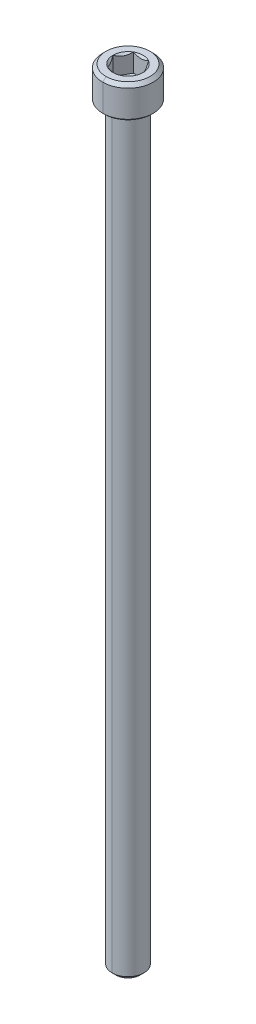
ISO-10303-21;
HEADER;
FILE_DESCRIPTION(('STEP AP214'),'2;1');
FILE_NAME('part.step','',(''),(''),'','','');
FILE_SCHEMA(('AUTOMOTIVE_DESIGN { 1 0 10303 214 1 1 1 1 }'));
ENDSEC;
DATA;
#1=APPLICATION_CONTEXT('core data for automotive mechanical design processes');
#2=APPLICATION_PROTOCOL_DEFINITION('international standard','automotive_design',2000,#1);
#3=PRODUCT_CONTEXT('',#1,'mechanical');
#4=PRODUCT('Part','Part','',(#3));
#5=PRODUCT_RELATED_PRODUCT_CATEGORY('part','',(#4));
#6=PRODUCT_DEFINITION_FORMATION('','',#4);
#7=PRODUCT_DEFINITION_CONTEXT('part definition',#1,'design');
#8=PRODUCT_DEFINITION('design','',#6,#7);
#9=PRODUCT_DEFINITION_SHAPE('','',#8);
#10=(LENGTH_UNIT() NAMED_UNIT(*) SI_UNIT(.MILLI.,.METRE.));
#11=(NAMED_UNIT(*) PLANE_ANGLE_UNIT() SI_UNIT($,.RADIAN.));
#12=(NAMED_UNIT(*) SI_UNIT($,.STERADIAN.) SOLID_ANGLE_UNIT());
#13=UNCERTAINTY_MEASURE_WITH_UNIT(LENGTH_MEASURE(1.E-05),#10,'distance_accuracy_value','');
#14=(GEOMETRIC_REPRESENTATION_CONTEXT(3) GLOBAL_UNCERTAINTY_ASSIGNED_CONTEXT((#13)) GLOBAL_UNIT_ASSIGNED_CONTEXT((#10,
#11,#12)) REPRESENTATION_CONTEXT('',''));
#15=CARTESIAN_POINT('',(0.,0.,0.));
#16=DIRECTION('',(0.,0.,1.));
#17=DIRECTION('',(1.,0.,0.));
#18=AXIS2_PLACEMENT_3D('',#15,#16,#17);
#19=CARTESIAN_POINT('',(0.,-0.152399999999997,0.));
#20=DIRECTION('',(0.,1.,0.));
#21=DIRECTION('',(0.,0.,1.));
#22=AXIS2_PLACEMENT_3D('',#19,#20,#21);
#23=TOROIDAL_SURFACE('',#22,2.5654,0.1524);
#24=CARTESIAN_POINT('',(0.,-0.152399999999997,-2.5654));
#25=DIRECTION('',(1.,0.,0.));
#26=DIRECTION('',(0.,0.,-1.));
#27=AXIS2_PLACEMENT_3D('',#24,#25,#26);
#28=CIRCLE('',#27,0.1524);
#29=CARTESIAN_POINT('',(0.,0.,-2.5654));
#30=VERTEX_POINT('',#29);
#31=CARTESIAN_POINT('',(0.,-0.152399999999997,-2.413));
#32=VERTEX_POINT('',#31);
#33=EDGE_CURVE('E203',#30,#32,#28,.T.);
#34=ORIENTED_EDGE('',*,*,#33,.F.);
#35=CARTESIAN_POINT('',(0.,0.,0.));
#36=DIRECTION('',(0.,1.,0.));
#37=DIRECTION('',(0.,0.,1.));
#38=AXIS2_PLACEMENT_3D('',#35,#36,#37);
#39=CIRCLE('',#38,2.5654);
#40=CARTESIAN_POINT('',(0.,0.,2.5654));
#41=VERTEX_POINT('',#40);
#42=EDGE_CURVE('E225',#41,#30,#39,.T.);
#43=ORIENTED_EDGE('',*,*,#42,.F.);
#44=CARTESIAN_POINT('',(0.,-0.152399999999997,2.5654));
#45=DIRECTION('',(-1.,0.,0.));
#46=DIRECTION('',(0.,0.,1.));
#47=AXIS2_PLACEMENT_3D('',#44,#45,#46);
#48=CIRCLE('',#47,0.1524);
#49=CARTESIAN_POINT('',(0.,-0.152399999999997,2.413));
#50=VERTEX_POINT('',#49);
#51=EDGE_CURVE('E250',#41,#50,#48,.T.);
#52=ORIENTED_EDGE('',*,*,#51,.T.);
#53=CARTESIAN_POINT('',(0.,-0.152399999999997,0.));
#54=DIRECTION('',(0.,-1.,0.));
#55=DIRECTION('',(0.,0.,1.));
#56=AXIS2_PLACEMENT_3D('',#53,#54,#55);
#57=CIRCLE('',#56,2.413);
#58=EDGE_CURVE('E235',#32,#50,#57,.T.);
#59=ORIENTED_EDGE('',*,*,#58,.F.);
#60=EDGE_LOOP('',(#34,#43,#52,#59));
#61=FACE_BOUND('',#60,.T.);
#62=ADVANCED_FACE('F16',(#61),#23,.F.);
#63=CARTESIAN_POINT('',(2.28769270663697,2.032,0.));
#64=DIRECTION('',(0.866025403784439,0.,-0.5));
#65=DIRECTION('',(0.,-1.,0.));
#66=AXIS2_PLACEMENT_3D('',#63,#64,#65);
#67=PLANE('',#66);
#68=DIRECTION('',(0.,1.,0.));
#69=VECTOR('',#68,1.);
#70=CARTESIAN_POINT('',(2.28769270663697,2.032,0.));
#71=LINE('',#70,#69);
#72=CARTESIAN_POINT('',(2.28769270663697,2.032,0.));
#73=VERTEX_POINT('',#72);
#74=CARTESIAN_POINT('',(2.28769270663697,4.826,0.));
#75=VERTEX_POINT('',#74);
#76=EDGE_CURVE('E11',#73,#75,#71,.T.);
#77=ORIENTED_EDGE('',*,*,#76,.T.);
#78=CARTESIAN_POINT('',(2.28769270663697,4.826,0.));
#79=CARTESIAN_POINT('',(2.14317957440595,4.68148686776898,-0.250304087385059));
#80=CARTESIAN_POINT('',(2.01227876614631,4.6063557329633,-0.477030938042588));
#81=CARTESIAN_POINT('',(1.86218187125153,4.52020691391333,-0.737006386058674));
#82=CARTESIAN_POINT('',(1.71787595811445,4.51951177250135,-0.986951559444716));
#83=CARTESIAN_POINT('',(1.5738329827954,4.51881789769698,-1.23644131117069));
#84=CARTESIAN_POINT('',(1.42308868167617,4.6041731544126,-1.49753809966066));
#85=CARTESIAN_POINT('',(1.29072619033411,4.67912016298365,-1.7267966596815));
#86=CARTESIAN_POINT('',(1.14384635331849,4.826,-1.9812));
#87=B_SPLINE_CURVE_WITH_KNOTS('',2,(#78,#79,#80,#81,#82,#83,#84,#85,#86),.UNSPECIFIED.,.F.,.F.,
(3,2,2,2,3),(0.,0.25,0.5,0.75,1.),.UNSPECIFIED.);
#88=CARTESIAN_POINT('',(1.14384635331849,4.826,-1.9812));
#89=VERTEX_POINT('',#88);
#90=EDGE_CURVE('E276',#75,#89,#87,.T.);
#91=ORIENTED_EDGE('',*,*,#90,.T.);
#92=DIRECTION('',(0.,1.,0.));
#93=VECTOR('',#92,1.);
#94=CARTESIAN_POINT('',(1.14384635331849,2.032,-1.9812));
#95=LINE('',#94,#93);
#96=CARTESIAN_POINT('',(1.14384635331849,2.032,-1.9812));
#97=VERTEX_POINT('',#96);
#98=EDGE_CURVE('E409',#97,#89,#95,.T.);
#99=ORIENTED_EDGE('',*,*,#98,.F.);
#100=DIRECTION('',(-0.5,0.,-0.866025403784439));
#101=VECTOR('',#100,1.);
#102=CARTESIAN_POINT('',(2.28769270663697,2.032,0.));
#103=LINE('',#102,#101);
#104=EDGE_CURVE('E270',#73,#97,#103,.T.);
#105=ORIENTED_EDGE('',*,*,#104,.F.);
#106=EDGE_LOOP('',(#77,#91,#99,#105));
#107=FACE_BOUND('',#106,.T.);
#108=ADVANCED_FACE('F283',(#107),#67,.F.);
#109=CARTESIAN_POINT('',(1.14384635331849,2.032,1.9812));
#110=DIRECTION('',(0.866025403784439,0.,0.5));
#111=DIRECTION('',(0.,-1.,0.));
#112=AXIS2_PLACEMENT_3D('',#109,#110,#111);
#113=PLANE('',#112);
#114=DIRECTION('',(0.,1.,0.));
#115=VECTOR('',#114,1.);
#116=CARTESIAN_POINT('',(1.14384635331849,2.032,1.9812));
#117=LINE('',#116,#115);
#118=CARTESIAN_POINT('',(1.14384635331849,2.032,1.9812));
#119=VERTEX_POINT('',#118);
#120=CARTESIAN_POINT('',(1.14384635331849,4.826,1.9812));
#121=VERTEX_POINT('',#120);
#122=EDGE_CURVE('E29',#119,#121,#117,.T.);
#123=ORIENTED_EDGE('',*,*,#122,.T.);
#124=CARTESIAN_POINT('',(1.14384635331849,4.826,1.9812));
#125=CARTESIAN_POINT('',(1.28835948554838,4.6814868677701,1.7308959126169));
#126=CARTESIAN_POINT('',(1.41926029380915,4.60635573296329,1.50416906195741));
#127=CARTESIAN_POINT('',(1.56935718870215,4.5202069139138,1.24419361394442));
#128=CARTESIAN_POINT('',(1.71366310184101,4.51951177250135,0.994248440555283));
#129=CARTESIAN_POINT('',(1.85770607715928,4.51881789769651,0.744758688830662));
#130=CARTESIAN_POINT('',(2.00845037827929,4.6041731544126,0.48366190033934));
#131=CARTESIAN_POINT('',(2.14081286962138,4.67912016298368,0.254403340318435));
#132=CARTESIAN_POINT('',(2.28769270663697,4.826,0.));
#133=B_SPLINE_CURVE_WITH_KNOTS('',2,(#124,#125,#126,#127,#128,#129,#130,#131,#132),
.UNSPECIFIED.,.F.,.F.,(3,2,2,2,3),(0.,0.25,0.5,0.75,1.),.UNSPECIFIED.);
#134=EDGE_CURVE('E474',#121,#75,#133,.T.);
#135=ORIENTED_EDGE('',*,*,#134,.T.);
#136=ORIENTED_EDGE('',*,*,#76,.F.);
#137=DIRECTION('',(0.5,0.,-0.866025403784439));
#138=VECTOR('',#137,1.);
#139=CARTESIAN_POINT('',(1.14384635331849,2.032,1.9812));
#140=LINE('',#139,#138);
#141=EDGE_CURVE('E462',#119,#73,#140,.T.);
#142=ORIENTED_EDGE('',*,*,#141,.F.);
#143=EDGE_LOOP('',(#123,#135,#136,#142));
#144=FACE_BOUND('',#143,.T.);
#145=ADVANCED_FACE('F293',(#144),#113,.F.);
#146=CARTESIAN_POINT('',(-1.14384635331848,2.032,1.9812));
#147=DIRECTION('',(0.,0.,1.));
#148=DIRECTION('',(1.,0.,0.));
#149=AXIS2_PLACEMENT_3D('',#146,#147,#148);
#150=PLANE('',#149);
#151=DIRECTION('',(0.,1.,0.));
#152=VECTOR('',#151,1.);
#153=CARTESIAN_POINT('',(-1.14384635331848,2.032,1.9812));
#154=LINE('',#153,#152);
#155=CARTESIAN_POINT('',(-1.14384635331848,2.032,1.9812));
#156=VERTEX_POINT('',#155);
#157=CARTESIAN_POINT('',(-1.14384635331848,4.826,1.9812));
#158=VERTEX_POINT('',#157);
#159=EDGE_CURVE('E508',#156,#158,#154,.T.);
#160=ORIENTED_EDGE('',*,*,#159,.T.);
#161=CARTESIAN_POINT('',(-1.14384635331848,4.826,1.9812));
#162=CARTESIAN_POINT('',(-0.852604529161856,4.68037908792168,1.9812));
#163=CARTESIAN_POINT('',(-0.58892975472875,4.6051869937822,1.9812));
#164=CARTESIAN_POINT('',(-0.288478278545423,4.51950729336303,1.9812));
#165=CARTESIAN_POINT('',(0.,4.51950729336303,1.9812));
#166=B_SPLINE_CURVE_WITH_KNOTS('',2,(#161,#162,#163,#164,#165),.UNSPECIFIED.,.F.,.F.,(3,2,3),
(0.,0.5,1.),.UNSPECIFIED.);
#167=CARTESIAN_POINT('',(0.,4.51950729336303,1.9812));
#168=VERTEX_POINT('',#167);
#169=EDGE_CURVE('E513',#158,#168,#166,.T.);
#170=ORIENTED_EDGE('',*,*,#169,.T.);
#171=CARTESIAN_POINT('',(0.,4.51950729336303,1.9812));
#172=CARTESIAN_POINT('',(0.287946815411568,4.51950729336303,1.9812));
#173=CARTESIAN_POINT('',(0.588849780232636,4.60516420753973,1.9812));
#174=CARTESIAN_POINT('',(0.851987770474281,4.68007070857789,1.9812));
#175=CARTESIAN_POINT('',(1.14384635331849,4.826,1.9812));
#176=B_SPLINE_CURVE_WITH_KNOTS('',2,(#171,#172,#173,#174,#175),.UNSPECIFIED.,.F.,.F.,(3,2,3),
(0.,0.5,1.),.UNSPECIFIED.);
#177=EDGE_CURVE('E266',#168,#121,#176,.T.);
#178=ORIENTED_EDGE('',*,*,#177,.T.);
#179=ORIENTED_EDGE('',*,*,#122,.F.);
#180=DIRECTION('',(1.,0.,0.));
#181=VECTOR('',#180,1.);
#182=CARTESIAN_POINT('',(-1.14384635331848,2.032,1.9812));
#183=LINE('',#182,#181);
#184=EDGE_CURVE('E201',#156,#119,#183,.T.);
#185=ORIENTED_EDGE('',*,*,#184,.F.);
#186=EDGE_LOOP('',(#160,#170,#178,#179,#185));
#187=FACE_BOUND('',#186,.T.);
#188=ADVANCED_FACE('F296',(#187),#150,.F.);
#189=CARTESIAN_POINT('',(-2.28769270663697,2.032,0.));
#190=DIRECTION('',(-0.866025403784438,0.,0.5));
#191=DIRECTION('',(0.,1.,0.));
#192=AXIS2_PLACEMENT_3D('',#189,#190,#191);
#193=PLANE('',#192);
#194=DIRECTION('',(0.,1.,0.));
#195=VECTOR('',#194,1.);
#196=CARTESIAN_POINT('',(-2.28769270663697,2.032,0.));
#197=LINE('',#196,#195);
#198=CARTESIAN_POINT('',(-2.28769270663697,2.032,0.));
#199=VERTEX_POINT('',#198);
#200=CARTESIAN_POINT('',(-2.28769270663697,4.826,0.));
#201=VERTEX_POINT('',#200);
#202=EDGE_CURVE('E408',#199,#201,#197,.T.);
#203=ORIENTED_EDGE('',*,*,#202,.T.);
#204=CARTESIAN_POINT('',(-2.28769270663697,4.826,0.));
#205=CARTESIAN_POINT('',(-2.14317957440604,4.68148686776907,0.250304087384906));
#206=CARTESIAN_POINT('',(-2.01227876614631,4.6063557329633,0.477030938042588));
#207=CARTESIAN_POINT('',(-1.8621818712512,4.5202069139131,0.737006386059238));
#208=CARTESIAN_POINT('',(-1.71787595811445,4.51951177250135,0.986951559444715));
#209=CARTESIAN_POINT('',(-1.57383298279637,4.51881789769721,1.23644131116902));
#210=CARTESIAN_POINT('',(-1.42308868167617,4.6041731544126,1.49753809966066));
#211=CARTESIAN_POINT('',(-1.2907261903357,4.67912016298207,1.72679665967875));
#212=CARTESIAN_POINT('',(-1.14384635331849,4.826,1.9812));
#213=B_SPLINE_CURVE_WITH_KNOTS('',2,(#204,#205,#206,#207,#208,#209,#210,#211,#212),
.UNSPECIFIED.,.F.,.F.,(3,2,2,2,3),(0.,0.25,0.5,0.75,1.),.UNSPECIFIED.);
#214=EDGE_CURVE('E346',#201,#158,#213,.T.);
#215=ORIENTED_EDGE('',*,*,#214,.T.);
#216=ORIENTED_EDGE('',*,*,#159,.F.);
#217=DIRECTION('',(0.5,0.,0.866025403784439));
#218=VECTOR('',#217,1.);
#219=CARTESIAN_POINT('',(-2.28769270663697,2.032,0.));
#220=LINE('',#219,#218);
#221=EDGE_CURVE('E238',#199,#156,#220,.T.);
#222=ORIENTED_EDGE('',*,*,#221,.F.);
#223=EDGE_LOOP('',(#203,#215,#216,#222));
#224=FACE_BOUND('',#223,.T.);
#225=ADVANCED_FACE('F300',(#224),#193,.F.);
#226=CARTESIAN_POINT('',(-1.14384635331849,2.032,-1.9812));
#227=DIRECTION('',(-0.866025403784439,0.,-0.5));
#228=DIRECTION('',(-0.5,0.,0.866025403784439));
#229=AXIS2_PLACEMENT_3D('',#226,#227,#228);
#230=PLANE('',#229);
#231=DIRECTION('',(0.,1.,0.));
#232=VECTOR('',#231,1.);
#233=CARTESIAN_POINT('',(-1.14384635331849,2.032,-1.9812));
#234=LINE('',#233,#232);
#235=CARTESIAN_POINT('',(-1.14384635331849,2.032,-1.9812));
#236=VERTEX_POINT('',#235);
#237=CARTESIAN_POINT('',(-1.14384635331849,4.826,-1.9812));
#238=VERTEX_POINT('',#237);
#239=EDGE_CURVE('E400',#236,#238,#234,.T.);
#240=ORIENTED_EDGE('',*,*,#239,.T.);
#241=CARTESIAN_POINT('',(-1.14384635331849,4.826,-1.9812));
#242=CARTESIAN_POINT('',(-1.28835948554886,4.68148686776963,-1.73089591261607));
#243=CARTESIAN_POINT('',(-1.41926029380915,4.6063557329633,-1.50416906195741));
#244=CARTESIAN_POINT('',(-1.56935718870378,4.5202069139131,-1.24419361394159));
#245=CARTESIAN_POINT('',(-1.71366310184101,4.51951177250136,-0.994248440555283));
#246=CARTESIAN_POINT('',(-1.85770607715962,4.51881789769721,-0.744758688830066));
#247=CARTESIAN_POINT('',(-2.00845037827929,4.6041731544126,-0.48366190033934));
#248=CARTESIAN_POINT('',(-2.14081286962037,4.67912016298268,-0.254403340320189));
#249=CARTESIAN_POINT('',(-2.28769270663697,4.826,0.));
#250=B_SPLINE_CURVE_WITH_KNOTS('',2,(#241,#242,#243,#244,#245,#246,#247,#248,#249),
.UNSPECIFIED.,.F.,.F.,(3,2,2,2,3),(0.,0.25,0.5,0.75,1.),.UNSPECIFIED.);
#251=EDGE_CURVE('E395',#238,#201,#250,.T.);
#252=ORIENTED_EDGE('',*,*,#251,.T.);
#253=ORIENTED_EDGE('',*,*,#202,.F.);
#254=DIRECTION('',(-0.5,0.,0.866025403784439));
#255=VECTOR('',#254,1.);
#256=CARTESIAN_POINT('',(-1.14384635331849,2.032,-1.9812));
#257=LINE('',#256,#255);
#258=EDGE_CURVE('E242',#236,#199,#257,.T.);
#259=ORIENTED_EDGE('',*,*,#258,.F.);
#260=EDGE_LOOP('',(#240,#252,#253,#259));
#261=FACE_BOUND('',#260,.T.);
#262=ADVANCED_FACE('F362',(#261),#230,.F.);
#263=CARTESIAN_POINT('',(1.14384635331849,2.032,-1.9812));
#264=DIRECTION('',(0.,0.,-1.));
#265=DIRECTION('',(0.,-1.,0.));
#266=AXIS2_PLACEMENT_3D('',#263,#264,#265);
#267=PLANE('',#266);
#268=ORIENTED_EDGE('',*,*,#98,.T.);
#269=CARTESIAN_POINT('',(1.14384635331849,4.826,-1.9812));
#270=CARTESIAN_POINT('',(0.852681268449242,4.68041745756538,-1.9812));
#271=CARTESIAN_POINT('',(0.589071853179802,4.60522748732522,-1.9812));
#272=CARTESIAN_POINT('',(0.289065178881829,4.51965583621686,-1.9812));
#273=CARTESIAN_POINT('',(0.000466056341207922,4.51950734818044,-1.9812));
#274=CARTESIAN_POINT('',(-0.28735920168427,4.51935925830747,-1.9812));
#275=CARTESIAN_POINT('',(-0.588708500274589,4.60512396116295,-1.9812));
#276=CARTESIAN_POINT('',(-0.851909486810259,4.68003156674588,-1.9812));
#277=CARTESIAN_POINT('',(-1.14384635331849,4.826,-1.9812));
#278=B_SPLINE_CURVE_WITH_KNOTS('',2,(#269,#270,#271,#272,#273,#274,#275,#276,#277),
.UNSPECIFIED.,.F.,.F.,(3,2,2,2,3),(0.,0.25,0.5,0.75,1.),.UNSPECIFIED.);
#279=EDGE_CURVE('E414',#89,#238,#278,.T.);
#280=ORIENTED_EDGE('',*,*,#279,.T.);
#281=ORIENTED_EDGE('',*,*,#239,.F.);
#282=DIRECTION('',(-1.,0.,0.));
#283=VECTOR('',#282,1.);
#284=CARTESIAN_POINT('',(1.14384635331849,2.032,-1.9812));
#285=LINE('',#284,#283);
#286=EDGE_CURVE('E267',#97,#236,#285,.T.);
#287=ORIENTED_EDGE('',*,*,#286,.F.);
#288=EDGE_LOOP('',(#268,#280,#281,#287));
#289=FACE_BOUND('',#288,.T.);
#290=ADVANCED_FACE('F375',(#289),#267,.F.);
#291=CARTESIAN_POINT('',(0.,2.032,0.));
#292=DIRECTION('',(0.,1.,0.));
#293=DIRECTION('',(1.,0.,0.));
#294=AXIS2_PLACEMENT_3D('',#291,#292,#293);
#295=PLANE('',#294);
#296=ORIENTED_EDGE('',*,*,#104,.T.);
#297=ORIENTED_EDGE('',*,*,#286,.T.);
#298=ORIENTED_EDGE('',*,*,#258,.T.);
#299=ORIENTED_EDGE('',*,*,#221,.T.);
#300=ORIENTED_EDGE('',*,*,#184,.T.);
#301=ORIENTED_EDGE('',*,*,#141,.T.);
#302=EDGE_LOOP('',(#296,#297,#298,#299,#300,#301));
#303=FACE_BOUND('',#302,.T.);
#304=ADVANCED_FACE('F294',(#303),#295,.T.);
#305=CARTESIAN_POINT('',(0.,4.826,0.));
#306=DIRECTION('',(0.,1.,0.));
#307=DIRECTION('',(0.,0.,1.));
#308=AXIS2_PLACEMENT_3D('',#305,#306,#307);
#309=CONICAL_SURFACE('',#308,2.28769270663697,0.78539816339745);
#310=CARTESIAN_POINT('',(0.,4.826,0.));
#311=DIRECTION('',(0.,1.,0.));
#312=DIRECTION('',(0.,0.,1.));
#313=AXIS2_PLACEMENT_3D('',#310,#311,#312);
#314=CIRCLE('',#313,2.28769270663697);
#315=EDGE_CURVE('E226',#75,#89,#314,.T.);
#316=ORIENTED_EDGE('',*,*,#315,.T.);
#317=ORIENTED_EDGE('',*,*,#90,.F.);
#318=EDGE_LOOP('',(#316,#317));
#319=FACE_BOUND('',#318,.T.);
#320=ADVANCED_FACE('F432',(#319),#309,.F.);
#321=CARTESIAN_POINT('',(0.,4.826,0.));
#322=DIRECTION('',(0.,1.,0.));
#323=DIRECTION('',(0.,0.,1.));
#324=AXIS2_PLACEMENT_3D('',#321,#322,#323);
#325=CONICAL_SURFACE('',#324,2.28769270663697,0.78539816339745);
#326=CARTESIAN_POINT('',(0.,4.826,0.));
#327=DIRECTION('',(0.,1.,0.));
#328=DIRECTION('',(0.,0.,1.));
#329=AXIS2_PLACEMENT_3D('',#326,#327,#328);
#330=CIRCLE('',#329,2.28769270663697);
#331=EDGE_CURVE('E453',#121,#75,#330,.T.);
#332=ORIENTED_EDGE('',*,*,#331,.T.);
#333=ORIENTED_EDGE('',*,*,#134,.F.);
#334=EDGE_LOOP('',(#332,#333));
#335=FACE_BOUND('',#334,.T.);
#336=ADVANCED_FACE('F435',(#335),#325,.F.);
#337=CARTESIAN_POINT('',(0.,4.826,0.));
#338=DIRECTION('',(0.,1.,0.));
#339=DIRECTION('',(0.,0.,1.));
#340=AXIS2_PLACEMENT_3D('',#337,#338,#339);
#341=CONICAL_SURFACE('',#340,2.28769270663697,0.78539816339745);
#342=DIRECTION('',(0.,0.707106781186546,0.707106781186549));
#343=VECTOR('',#342,1.);
#344=CARTESIAN_POINT('',(0.,4.826,2.28769270663697));
#345=LINE('',#344,#343);
#346=CARTESIAN_POINT('',(0.,4.826,2.28769270663697));
#347=VERTEX_POINT('',#346);
#348=EDGE_CURVE('E324',#168,#347,#345,.T.);
#349=ORIENTED_EDGE('',*,*,#348,.F.);
#350=ORIENTED_EDGE('',*,*,#169,.F.);
#351=CARTESIAN_POINT('',(0.,4.826,0.));
#352=DIRECTION('',(0.,1.,0.));
#353=DIRECTION('',(0.,0.,1.));
#354=AXIS2_PLACEMENT_3D('',#351,#352,#353);
#355=CIRCLE('',#354,2.28769270663697);
#356=EDGE_CURVE('E457',#158,#347,#355,.T.);
#357=ORIENTED_EDGE('',*,*,#356,.T.);
#358=EDGE_LOOP('',(#349,#350,#357));
#359=FACE_BOUND('',#358,.T.);
#360=ADVANCED_FACE('F495',(#359),#341,.F.);
#361=CARTESIAN_POINT('',(0.,4.826,0.));
#362=DIRECTION('',(0.,1.,0.));
#363=DIRECTION('',(0.,0.,1.));
#364=AXIS2_PLACEMENT_3D('',#361,#362,#363);
#365=CONICAL_SURFACE('',#364,2.28769270663697,0.78539816339745);
#366=CARTESIAN_POINT('',(0.,4.826,0.));
#367=DIRECTION('',(0.,1.,0.));
#368=DIRECTION('',(0.,0.,1.));
#369=AXIS2_PLACEMENT_3D('',#366,#367,#368);
#370=CIRCLE('',#369,2.28769270663697);
#371=EDGE_CURVE('E520',#201,#158,#370,.T.);
#372=ORIENTED_EDGE('',*,*,#371,.T.);
#373=ORIENTED_EDGE('',*,*,#214,.F.);
#374=EDGE_LOOP('',(#372,#373));
#375=FACE_BOUND('',#374,.T.);
#376=ADVANCED_FACE('F584',(#375),#365,.F.);
#377=CARTESIAN_POINT('',(0.,4.826,0.));
#378=DIRECTION('',(0.,1.,0.));
#379=DIRECTION('',(0.,0.,1.));
#380=AXIS2_PLACEMENT_3D('',#377,#378,#379);
#381=CONICAL_SURFACE('',#380,2.28769270663697,0.78539816339745);
#382=CARTESIAN_POINT('',(0.,4.826,0.));
#383=DIRECTION('',(0.,1.,0.));
#384=DIRECTION('',(0.,0.,1.));
#385=AXIS2_PLACEMENT_3D('',#382,#383,#384);
#386=CIRCLE('',#385,2.28769270663697);
#387=EDGE_CURVE('E467',#238,#201,#386,.T.);
#388=ORIENTED_EDGE('',*,*,#387,.T.);
#389=ORIENTED_EDGE('',*,*,#251,.F.);
#390=EDGE_LOOP('',(#388,#389));
#391=FACE_BOUND('',#390,.T.);
#392=ADVANCED_FACE('F363',(#391),#381,.F.);
#393=CARTESIAN_POINT('',(0.,4.826,0.));
#394=DIRECTION('',(0.,1.,0.));
#395=DIRECTION('',(0.,0.,1.));
#396=AXIS2_PLACEMENT_3D('',#393,#394,#395);
#397=CONICAL_SURFACE('',#396,2.28769270663697,0.78539816339745);
#398=CARTESIAN_POINT('',(0.,4.826,0.));
#399=DIRECTION('',(0.,1.,0.));
#400=DIRECTION('',(0.,0.,1.));
#401=AXIS2_PLACEMENT_3D('',#398,#399,#400);
#402=CIRCLE('',#401,2.28769270663697);
#403=EDGE_CURVE('E450',#89,#238,#402,.T.);
#404=ORIENTED_EDGE('',*,*,#403,.T.);
#405=ORIENTED_EDGE('',*,*,#279,.F.);
#406=EDGE_LOOP('',(#404,#405));
#407=FACE_BOUND('',#406,.T.);
#408=ADVANCED_FACE('F430',(#407),#397,.F.);
#409=CARTESIAN_POINT('',(0.,0.22860000000002,0.));
#410=DIRECTION('',(0.,1.,0.));
#411=DIRECTION('',(0.,0.,1.));
#412=AXIS2_PLACEMENT_3D('',#409,#410,#411);
#413=CONICAL_SURFACE('',#412,3.8354,0.785398163397448);
#414=DIRECTION('',(0.,0.707106781186548,-0.707106781186547));
#415=VECTOR('',#414,1.);
#416=CARTESIAN_POINT('',(0.,0.22860000000002,-3.8354));
#417=LINE('',#416,#415);
#418=CARTESIAN_POINT('',(0.,0.,-3.6068));
#419=VERTEX_POINT('',#418);
#420=CARTESIAN_POINT('',(0.,0.22860000000002,-3.8354));
#421=VERTEX_POINT('',#420);
#422=EDGE_CURVE('E212',#419,#421,#417,.T.);
#423=ORIENTED_EDGE('',*,*,#422,.F.);
#424=CARTESIAN_POINT('',(0.,0.,0.));
#425=DIRECTION('',(0.,-1.,0.));
#426=DIRECTION('',(0.,0.,1.));
#427=AXIS2_PLACEMENT_3D('',#424,#425,#426);
#428=CIRCLE('',#427,3.6068);
#429=CARTESIAN_POINT('',(0.,0.,3.6068));
#430=VERTEX_POINT('',#429);
#431=EDGE_CURVE('E222',#430,#419,#428,.T.);
#432=ORIENTED_EDGE('',*,*,#431,.F.);
#433=DIRECTION('',(0.,0.707106781186548,0.707106781186547));
#434=VECTOR('',#433,1.);
#435=CARTESIAN_POINT('',(0.,0.22860000000002,3.8354));
#436=LINE('',#435,#434);
#437=CARTESIAN_POINT('',(0.,0.22860000000002,3.8354));
#438=VERTEX_POINT('',#437);
#439=EDGE_CURVE('E197',#430,#438,#436,.T.);
#440=ORIENTED_EDGE('',*,*,#439,.T.);
#441=CARTESIAN_POINT('',(0.,0.22860000000002,0.));
#442=DIRECTION('',(0.,1.,0.));
#443=DIRECTION('',(0.,0.,1.));
#444=AXIS2_PLACEMENT_3D('',#441,#442,#443);
#445=CIRCLE('',#444,3.8354);
#446=EDGE_CURVE('E144',#421,#438,#445,.T.);
#447=ORIENTED_EDGE('',*,*,#446,.F.);
#448=EDGE_LOOP('',(#423,#432,#440,#447));
#449=FACE_BOUND('',#448,.T.);
#450=ADVANCED_FACE('F427',(#449),#413,.T.);
#451=CARTESIAN_POINT('',(0.,4.826,0.));
#452=DIRECTION('',(0.,-1.,0.));
#453=DIRECTION('',(0.,0.,-1.));
#454=AXIS2_PLACEMENT_3D('',#451,#452,#453);
#455=CONICAL_SURFACE('',#454,3.3354,0.785398163397449);
#456=DIRECTION('',(0.,-0.707106781186547,0.707106781186548));
#457=VECTOR('',#456,1.);
#458=CARTESIAN_POINT('',(0.,4.826,3.3354));
#459=LINE('',#458,#457);
#460=CARTESIAN_POINT('',(0.,4.826,3.3354));
#461=VERTEX_POINT('',#460);
#462=CARTESIAN_POINT('',(0.,4.326,3.8354));
#463=VERTEX_POINT('',#462);
#464=EDGE_CURVE('E166',#461,#463,#459,.T.);
#465=ORIENTED_EDGE('',*,*,#464,.F.);
#466=CARTESIAN_POINT('',(0.,4.826,0.));
#467=DIRECTION('',(0.,1.,0.));
#468=DIRECTION('',(0.,0.,1.));
#469=AXIS2_PLACEMENT_3D('',#466,#467,#468);
#470=CIRCLE('',#469,3.3354);
#471=CARTESIAN_POINT('',(0.,4.826,-3.3354));
#472=VERTEX_POINT('',#471);
#473=EDGE_CURVE('E130',#472,#461,#470,.T.);
#474=ORIENTED_EDGE('',*,*,#473,.F.);
#475=DIRECTION('',(0.,-0.707106781186547,-0.707106781186548));
#476=VECTOR('',#475,1.);
#477=CARTESIAN_POINT('',(0.,4.826,-3.3354));
#478=LINE('',#477,#476);
#479=CARTESIAN_POINT('',(0.,4.326,-3.8354));
#480=VERTEX_POINT('',#479);
#481=EDGE_CURVE('E169',#472,#480,#478,.T.);
#482=ORIENTED_EDGE('',*,*,#481,.T.);
#483=CARTESIAN_POINT('',(0.,4.326,0.));
#484=DIRECTION('',(0.,-1.,0.));
#485=DIRECTION('',(0.,0.,1.));
#486=AXIS2_PLACEMENT_3D('',#483,#484,#485);
#487=CIRCLE('',#486,3.8354);
#488=EDGE_CURVE('E163',#463,#480,#487,.T.);
#489=ORIENTED_EDGE('',*,*,#488,.F.);
#490=EDGE_LOOP('',(#465,#474,#482,#489));
#491=FACE_BOUND('',#490,.T.);
#492=ADVANCED_FACE('F164',(#491),#455,.T.);
#493=CARTESIAN_POINT('',(0.,0.,0.));
#494=DIRECTION('',(0.,1.,0.));
#495=DIRECTION('',(1.,0.,0.));
#496=AXIS2_PLACEMENT_3D('',#493,#494,#495);
#497=PLANE('',#496);
#498=ORIENTED_EDGE('',*,*,#42,.T.);
#499=CARTESIAN_POINT('',(0.,0.,0.));
#500=DIRECTION('',(0.,1.,0.));
#501=DIRECTION('',(0.,0.,1.));
#502=AXIS2_PLACEMENT_3D('',#499,#500,#501);
#503=CIRCLE('',#502,2.5654);
#504=EDGE_CURVE('E208',#30,#41,#503,.T.);
#505=ORIENTED_EDGE('',*,*,#504,.T.);
#506=EDGE_LOOP('',(#498,#505));
#507=FACE_BOUND('',#506,.T.);
#508=ORIENTED_EDGE('',*,*,#431,.T.);
#509=CARTESIAN_POINT('',(0.,0.,0.));
#510=DIRECTION('',(0.,-1.,0.));
#511=DIRECTION('',(0.,0.,1.));
#512=AXIS2_PLACEMENT_3D('',#509,#510,#511);
#513=CIRCLE('',#512,3.6068);
#514=EDGE_CURVE('E257',#419,#430,#513,.T.);
#515=ORIENTED_EDGE('',*,*,#514,.T.);
#516=EDGE_LOOP('',(#508,#515));
#517=FACE_BOUND('',#516,.T.);
#518=ADVANCED_FACE('F583',(#507,#517),#497,.F.);
#519=CARTESIAN_POINT('',(0.,4.826,0.));
#520=DIRECTION('',(0.,1.,0.));
#521=DIRECTION('',(1.,0.,0.));
#522=AXIS2_PLACEMENT_3D('',#519,#520,#521);
#523=PLANE('',#522);
#524=ORIENTED_EDGE('',*,*,#331,.F.);
#525=CARTESIAN_POINT('',(0.,4.826,0.));
#526=DIRECTION('',(0.,1.,0.));
#527=DIRECTION('',(0.,0.,1.));
#528=AXIS2_PLACEMENT_3D('',#525,#526,#527);
#529=CIRCLE('',#528,2.28769270663697);
#530=EDGE_CURVE('E326',#347,#121,#529,.T.);
#531=ORIENTED_EDGE('',*,*,#530,.F.);
#532=ORIENTED_EDGE('',*,*,#356,.F.);
#533=ORIENTED_EDGE('',*,*,#371,.F.);
#534=ORIENTED_EDGE('',*,*,#387,.F.);
#535=ORIENTED_EDGE('',*,*,#403,.F.);
#536=ORIENTED_EDGE('',*,*,#315,.F.);
#537=EDGE_LOOP('',(#524,#531,#532,#533,#534,#535,#536));
#538=FACE_BOUND('',#537,.T.);
#539=ORIENTED_EDGE('',*,*,#473,.T.);
#540=CARTESIAN_POINT('',(0.,4.826,0.));
#541=DIRECTION('',(0.,1.,0.));
#542=DIRECTION('',(0.,0.,1.));
#543=AXIS2_PLACEMENT_3D('',#540,#541,#542);
#544=CIRCLE('',#543,3.3354);
#545=EDGE_CURVE('E190',#461,#472,#544,.T.);
#546=ORIENTED_EDGE('',*,*,#545,.T.);
#547=EDGE_LOOP('',(#539,#546));
#548=FACE_BOUND('',#547,.T.);
#549=ADVANCED_FACE('F522',(#538,#548),#523,.T.);
#550=CARTESIAN_POINT('',(0.,4.826,0.));
#551=DIRECTION('',(0.,-1.,0.));
#552=DIRECTION('',(0.,0.,-1.));
#553=AXIS2_PLACEMENT_3D('',#550,#551,#552);
#554=CYLINDRICAL_SURFACE('',#553,3.8354);
#555=DIRECTION('',(0.,-1.,0.));
#556=VECTOR('',#555,1.);
#557=CARTESIAN_POINT('',(0.,4.826,3.8354));
#558=LINE('',#557,#556);
#559=EDGE_CURVE('E175',#463,#438,#558,.T.);
#560=ORIENTED_EDGE('',*,*,#559,.F.);
#561=ORIENTED_EDGE('',*,*,#488,.T.);
#562=DIRECTION('',(0.,-1.,0.));
#563=VECTOR('',#562,1.);
#564=CARTESIAN_POINT('',(0.,4.826,-3.8354));
#565=LINE('',#564,#563);
#566=EDGE_CURVE('E182',#480,#421,#565,.T.);
#567=ORIENTED_EDGE('',*,*,#566,.T.);
#568=ORIENTED_EDGE('',*,*,#446,.T.);
#569=EDGE_LOOP('',(#560,#561,#567,#568));
#570=FACE_BOUND('',#569,.T.);
#571=ADVANCED_FACE('F177',(#570),#554,.T.);
#572=CARTESIAN_POINT('',(0.,-113.7158,0.));
#573=DIRECTION('',(0.,1.,0.));
#574=DIRECTION('',(0.,0.,1.));
#575=AXIS2_PLACEMENT_3D('',#572,#573,#574);
#576=CONICAL_SURFACE('',#575,2.413,0.785398163397438);
#577=DIRECTION('',(0.,0.707106781186555,-0.70710678118654));
#578=VECTOR('',#577,1.);
#579=CARTESIAN_POINT('',(0.,-113.7158,-2.413));
#580=LINE('',#579,#578);
#581=CARTESIAN_POINT('',(0.,-114.3,-1.8288));
#582=VERTEX_POINT('',#581);
#583=CARTESIAN_POINT('',(0.,-113.7158,-2.413));
#584=VERTEX_POINT('',#583);
#585=EDGE_CURVE('E216',#582,#584,#580,.T.);
#586=ORIENTED_EDGE('',*,*,#585,.F.);
#587=CARTESIAN_POINT('',(0.,-114.3,0.));
#588=DIRECTION('',(0.,-1.,0.));
#589=DIRECTION('',(0.,0.,1.));
#590=AXIS2_PLACEMENT_3D('',#587,#588,#589);
#591=CIRCLE('',#590,1.8288);
#592=CARTESIAN_POINT('',(0.,-114.3,1.8288));
#593=VERTEX_POINT('',#592);
#594=EDGE_CURVE('E173',#593,#582,#591,.T.);
#595=ORIENTED_EDGE('',*,*,#594,.F.);
#596=DIRECTION('',(0.,0.707106781186555,0.70710678118654));
#597=VECTOR('',#596,1.);
#598=CARTESIAN_POINT('',(0.,-113.7158,2.413));
#599=LINE('',#598,#597);
#600=CARTESIAN_POINT('',(0.,-113.7158,2.413));
#601=VERTEX_POINT('',#600);
#602=EDGE_CURVE('E230',#593,#601,#599,.T.);
#603=ORIENTED_EDGE('',*,*,#602,.T.);
#604=CARTESIAN_POINT('',(0.,-113.7158,0.));
#605=DIRECTION('',(0.,1.,0.));
#606=DIRECTION('',(0.,0.,1.));
#607=AXIS2_PLACEMENT_3D('',#604,#605,#606);
#608=CIRCLE('',#607,2.413);
#609=EDGE_CURVE('E215',#584,#601,#608,.T.);
#610=ORIENTED_EDGE('',*,*,#609,.F.);
#611=EDGE_LOOP('',(#586,#595,#603,#610));
#612=FACE_BOUND('',#611,.T.);
#613=ADVANCED_FACE('F564',(#612),#576,.T.);
#614=CARTESIAN_POINT('',(0.,-114.3,0.));
#615=DIRECTION('',(0.,1.,0.));
#616=DIRECTION('',(1.,0.,0.));
#617=AXIS2_PLACEMENT_3D('',#614,#615,#616);
#618=PLANE('',#617);
#619=ORIENTED_EDGE('',*,*,#594,.T.);
#620=CARTESIAN_POINT('',(0.,-114.3,0.));
#621=DIRECTION('',(0.,-1.,0.));
#622=DIRECTION('',(0.,0.,1.));
#623=AXIS2_PLACEMENT_3D('',#620,#621,#622);
#624=CIRCLE('',#623,1.8288);
#625=EDGE_CURVE('E221',#582,#593,#624,.T.);
#626=ORIENTED_EDGE('',*,*,#625,.T.);
#627=EDGE_LOOP('',(#619,#626));
#628=FACE_BOUND('',#627,.T.);
#629=ADVANCED_FACE('F573',(#628),#618,.F.);
#630=CARTESIAN_POINT('',(0.,-114.3,0.));
#631=DIRECTION('',(0.,1.,0.));
#632=DIRECTION('',(0.,0.,1.));
#633=AXIS2_PLACEMENT_3D('',#630,#631,#632);
#634=CYLINDRICAL_SURFACE('',#633,2.413);
#635=DIRECTION('',(0.,1.,0.));
#636=VECTOR('',#635,1.);
#637=CARTESIAN_POINT('',(0.,-114.3,-2.413));
#638=LINE('',#637,#636);
#639=EDGE_CURVE('E231',#584,#32,#638,.T.);
#640=ORIENTED_EDGE('',*,*,#639,.F.);
#641=ORIENTED_EDGE('',*,*,#609,.T.);
#642=DIRECTION('',(0.,1.,0.));
#643=VECTOR('',#642,1.);
#644=CARTESIAN_POINT('',(0.,-114.3,2.413));
#645=LINE('',#644,#643);
#646=EDGE_CURVE('E243',#601,#50,#645,.T.);
#647=ORIENTED_EDGE('',*,*,#646,.T.);
#648=CARTESIAN_POINT('',(0.,-0.152399999999997,0.));
#649=DIRECTION('',(0.,-1.,0.));
#650=DIRECTION('',(0.,0.,1.));
#651=AXIS2_PLACEMENT_3D('',#648,#649,#650);
#652=CIRCLE('',#651,2.413);
#653=EDGE_CURVE('E207',#50,#32,#652,.T.);
#654=ORIENTED_EDGE('',*,*,#653,.T.);
#655=EDGE_LOOP('',(#640,#641,#647,#654));
#656=FACE_BOUND('',#655,.T.);
#657=ADVANCED_FACE('F561',(#656),#634,.T.);
#658=CARTESIAN_POINT('',(0.,-114.3,0.));
#659=DIRECTION('',(0.,1.,0.));
#660=DIRECTION('',(0.,0.,1.));
#661=AXIS2_PLACEMENT_3D('',#658,#659,#660);
#662=CYLINDRICAL_SURFACE('',#661,2.413);
#663=CARTESIAN_POINT('',(0.,-113.7158,0.));
#664=DIRECTION('',(0.,1.,0.));
#665=DIRECTION('',(0.,0.,1.));
#666=AXIS2_PLACEMENT_3D('',#663,#664,#665);
#667=CIRCLE('',#666,2.413);
#668=EDGE_CURVE('E220',#601,#584,#667,.T.);
#669=ORIENTED_EDGE('',*,*,#668,.T.);
#670=ORIENTED_EDGE('',*,*,#639,.T.);
#671=ORIENTED_EDGE('',*,*,#58,.T.);
#672=ORIENTED_EDGE('',*,*,#646,.F.);
#673=EDGE_LOOP('',(#669,#670,#671,#672));
#674=FACE_BOUND('',#673,.T.);
#675=ADVANCED_FACE('F18',(#674),#662,.T.);
#676=CARTESIAN_POINT('',(0.,-113.7158,0.));
#677=DIRECTION('',(0.,1.,0.));
#678=DIRECTION('',(0.,0.,1.));
#679=AXIS2_PLACEMENT_3D('',#676,#677,#678);
#680=CONICAL_SURFACE('',#679,2.413,0.785398163397438);
#681=ORIENTED_EDGE('',*,*,#625,.F.);
#682=ORIENTED_EDGE('',*,*,#585,.T.);
#683=ORIENTED_EDGE('',*,*,#668,.F.);
#684=ORIENTED_EDGE('',*,*,#602,.F.);
#685=EDGE_LOOP('',(#681,#682,#683,#684));
#686=FACE_BOUND('',#685,.T.);
#687=ADVANCED_FACE('F571',(#686),#680,.T.);
#688=CARTESIAN_POINT('',(0.,4.826,0.));
#689=DIRECTION('',(0.,-1.,0.));
#690=DIRECTION('',(0.,0.,-1.));
#691=AXIS2_PLACEMENT_3D('',#688,#689,#690);
#692=CYLINDRICAL_SURFACE('',#691,3.8354);
#693=CARTESIAN_POINT('',(0.,4.326,0.));
#694=DIRECTION('',(0.,-1.,0.));
#695=DIRECTION('',(0.,0.,1.));
#696=AXIS2_PLACEMENT_3D('',#693,#694,#695);
#697=CIRCLE('',#696,3.8354);
#698=EDGE_CURVE('E184',#480,#463,#697,.T.);
#699=ORIENTED_EDGE('',*,*,#698,.T.);
#700=ORIENTED_EDGE('',*,*,#559,.T.);
#701=CARTESIAN_POINT('',(0.,0.22860000000002,0.));
#702=DIRECTION('',(0.,1.,0.));
#703=DIRECTION('',(0.,0.,1.));
#704=AXIS2_PLACEMENT_3D('',#701,#702,#703);
#705=CIRCLE('',#704,3.8354);
#706=EDGE_CURVE('E209',#438,#421,#705,.T.);
#707=ORIENTED_EDGE('',*,*,#706,.T.);
#708=ORIENTED_EDGE('',*,*,#566,.F.);
#709=EDGE_LOOP('',(#699,#700,#707,#708));
#710=FACE_BOUND('',#709,.T.);
#711=ADVANCED_FACE('F185',(#710),#692,.T.);
#712=CARTESIAN_POINT('',(0.,4.826,0.));
#713=DIRECTION('',(0.,-1.,0.));
#714=DIRECTION('',(0.,0.,-1.));
#715=AXIS2_PLACEMENT_3D('',#712,#713,#714);
#716=CONICAL_SURFACE('',#715,3.3354,0.785398163397449);
#717=ORIENTED_EDGE('',*,*,#545,.F.);
#718=ORIENTED_EDGE('',*,*,#464,.T.);
#719=ORIENTED_EDGE('',*,*,#698,.F.);
#720=ORIENTED_EDGE('',*,*,#481,.F.);
#721=EDGE_LOOP('',(#717,#718,#719,#720));
#722=FACE_BOUND('',#721,.T.);
#723=ADVANCED_FACE('F189',(#722),#716,.T.);
#724=CARTESIAN_POINT('',(0.,0.22860000000002,0.));
#725=DIRECTION('',(0.,1.,0.));
#726=DIRECTION('',(0.,0.,1.));
#727=AXIS2_PLACEMENT_3D('',#724,#725,#726);
#728=CONICAL_SURFACE('',#727,3.8354,0.785398163397448);
#729=ORIENTED_EDGE('',*,*,#514,.F.);
#730=ORIENTED_EDGE('',*,*,#422,.T.);
#731=ORIENTED_EDGE('',*,*,#706,.F.);
#732=ORIENTED_EDGE('',*,*,#439,.F.);
#733=EDGE_LOOP('',(#729,#730,#731,#732));
#734=FACE_BOUND('',#733,.T.);
#735=ADVANCED_FACE('F369',(#734),#728,.T.);
#736=CARTESIAN_POINT('',(0.,4.826,0.));
#737=DIRECTION('',(0.,1.,0.));
#738=DIRECTION('',(0.,0.,1.));
#739=AXIS2_PLACEMENT_3D('',#736,#737,#738);
#740=CONICAL_SURFACE('',#739,2.28769270663697,0.78539816339745);
#741=ORIENTED_EDGE('',*,*,#177,.F.);
#742=ORIENTED_EDGE('',*,*,#348,.T.);
#743=ORIENTED_EDGE('',*,*,#530,.T.);
#744=EDGE_LOOP('',(#741,#742,#743));
#745=FACE_BOUND('',#744,.T.);
#746=ADVANCED_FACE('F322',(#745),#740,.F.);
#747=CARTESIAN_POINT('',(0.,-0.152399999999997,0.));
#748=DIRECTION('',(0.,1.,0.));
#749=DIRECTION('',(0.,0.,1.));
#750=AXIS2_PLACEMENT_3D('',#747,#748,#749);
#751=TOROIDAL_SURFACE('',#750,2.5654,0.1524);
#752=ORIENTED_EDGE('',*,*,#504,.F.);
#753=ORIENTED_EDGE('',*,*,#33,.T.);
#754=ORIENTED_EDGE('',*,*,#653,.F.);
#755=ORIENTED_EDGE('',*,*,#51,.F.);
#756=EDGE_LOOP('',(#752,#753,#754,#755));
#757=FACE_BOUND('',#756,.T.);
#758=ADVANCED_FACE('F559',(#757),#751,.F.);
#759=CLOSED_SHELL('',(#62,#108,#145,#188,#225,#262,#290,#304,#320,#336,#360,#376,#392,#408,#450,
#492,#518,#549,#571,#613,#629,#657,#675,#687,#711,#723,#735,#746,#758));
#760=MANIFOLD_SOLID_BREP('B1',#759);
#761=ADVANCED_BREP_SHAPE_REPRESENTATION('',(#18,#760),#14);
#762=SHAPE_DEFINITION_REPRESENTATION(#9,#761);
ENDSEC;
END-ISO-10303-21;
